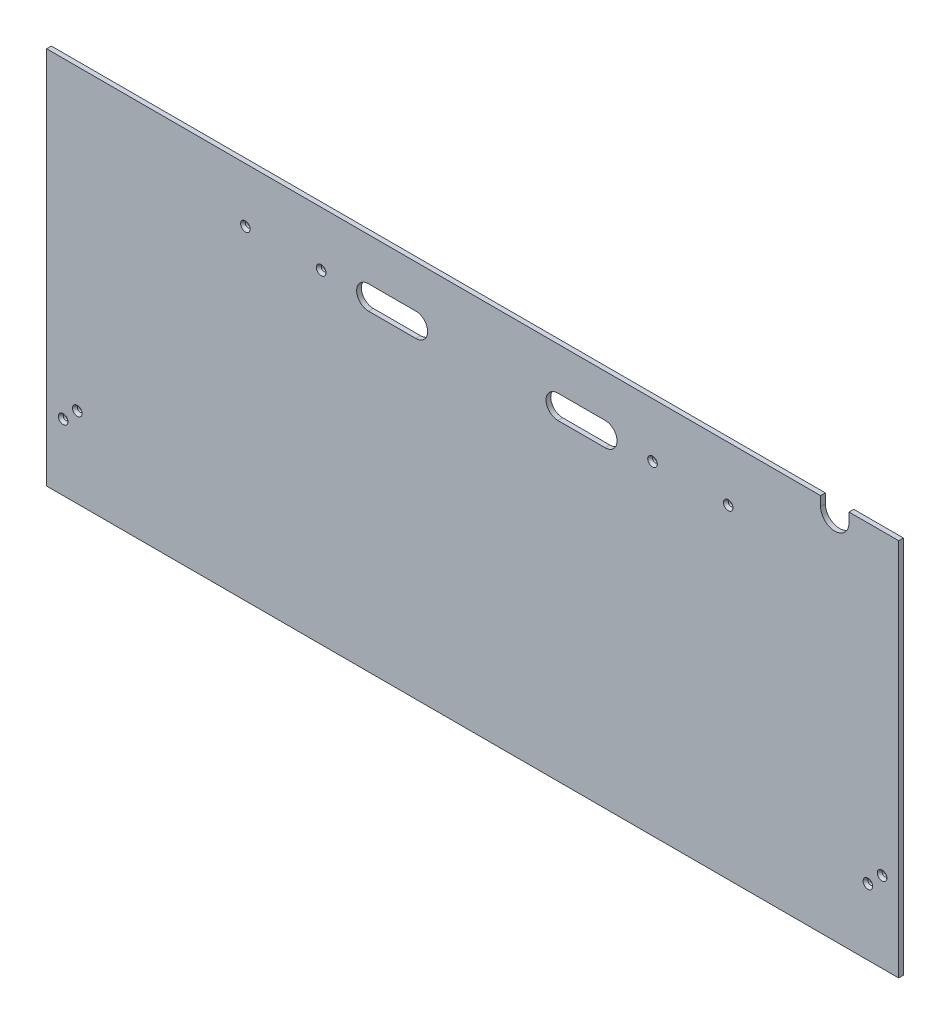
ISO-10303-21;
HEADER;
FILE_DESCRIPTION(('STEP AP214'),'2;1');
FILE_NAME('part.step','',(''),(''),'','','');
FILE_SCHEMA(('AUTOMOTIVE_DESIGN { 1 0 10303 214 1 1 1 1 }'));
ENDSEC;
DATA;
#1=APPLICATION_CONTEXT('core data for automotive mechanical design processes');
#2=APPLICATION_PROTOCOL_DEFINITION('international standard','automotive_design',2000,#1);
#3=PRODUCT_CONTEXT('',#1,'mechanical');
#4=PRODUCT('Part','Part','',(#3));
#5=PRODUCT_RELATED_PRODUCT_CATEGORY('part','',(#4));
#6=PRODUCT_DEFINITION_FORMATION('','',#4);
#7=PRODUCT_DEFINITION_CONTEXT('part definition',#1,'design');
#8=PRODUCT_DEFINITION('design','',#6,#7);
#9=PRODUCT_DEFINITION_SHAPE('','',#8);
#10=(LENGTH_UNIT() NAMED_UNIT(*) SI_UNIT(.MILLI.,.METRE.));
#11=(NAMED_UNIT(*) PLANE_ANGLE_UNIT() SI_UNIT($,.RADIAN.));
#12=(NAMED_UNIT(*) SI_UNIT($,.STERADIAN.) SOLID_ANGLE_UNIT());
#13=UNCERTAINTY_MEASURE_WITH_UNIT(LENGTH_MEASURE(1.E-05),#10,'distance_accuracy_value','');
#14=(GEOMETRIC_REPRESENTATION_CONTEXT(3) GLOBAL_UNCERTAINTY_ASSIGNED_CONTEXT((#13)) GLOBAL_UNIT_ASSIGNED_CONTEXT((#10,
#11,#12)) REPRESENTATION_CONTEXT('',''));
#15=CARTESIAN_POINT('',(0.,0.,0.));
#16=DIRECTION('',(0.,0.,1.));
#17=DIRECTION('',(1.,0.,0.));
#18=AXIS2_PLACEMENT_3D('',#15,#16,#17);
#19=CARTESIAN_POINT('',(0.,508.,6.35));
#20=DIRECTION('',(0.,-1.,0.));
#21=DIRECTION('',(0.,0.,-1.));
#22=AXIS2_PLACEMENT_3D('',#19,#20,#21);
#23=PLANE('',#22);
#24=DIRECTION('',(-1.,0.,0.));
#25=VECTOR('',#24,1.);
#26=CARTESIAN_POINT('',(0.,508.,6.35));
#27=LINE('',#26,#25);
#28=CARTESIAN_POINT('',(1038.225,508.,6.35));
#29=VERTEX_POINT('',#28);
#30=CARTESIAN_POINT('',(0.,508.,6.35));
#31=VERTEX_POINT('',#30);
#32=EDGE_CURVE('E324',#29,#31,#27,.T.);
#33=ORIENTED_EDGE('',*,*,#32,.F.);
#34=DIRECTION('',(0.,0.,1.));
#35=VECTOR('',#34,1.);
#36=CARTESIAN_POINT('',(1038.225,508.,0.));
#37=LINE('',#36,#35);
#38=CARTESIAN_POINT('',(1038.225,508.,0.));
#39=VERTEX_POINT('',#38);
#40=EDGE_CURVE('E175',#39,#29,#37,.T.);
#41=ORIENTED_EDGE('',*,*,#40,.F.);
#42=DIRECTION('',(-1.,0.,0.));
#43=VECTOR('',#42,1.);
#44=CARTESIAN_POINT('',(0.,508.,0.));
#45=LINE('',#44,#43);
#46=CARTESIAN_POINT('',(0.,508.,0.));
#47=VERTEX_POINT('',#46);
#48=EDGE_CURVE('E166',#39,#47,#45,.T.);
#49=ORIENTED_EDGE('',*,*,#48,.T.);
#50=DIRECTION('',(0.,0.,-1.));
#51=VECTOR('',#50,1.);
#52=CARTESIAN_POINT('',(0.,508.,6.35));
#53=LINE('',#52,#51);
#54=EDGE_CURVE('E328',#31,#47,#53,.T.);
#55=ORIENTED_EDGE('',*,*,#54,.F.);
#56=EDGE_LOOP('',(#33,#41,#49,#55));
#57=FACE_BOUND('',#56,.T.);
#58=ADVANCED_FACE('F32',(#57),#23,.F.);
#59=CARTESIAN_POINT('',(0.,0.,6.35));
#60=DIRECTION('',(0.,0.,-1.));
#61=DIRECTION('',(-1.,0.,0.));
#62=AXIS2_PLACEMENT_3D('',#59,#60,#61);
#63=PLANE('',#62);
#64=CARTESIAN_POINT('',(266.7,434.975,6.35));
#65=DIRECTION('',(0.,0.,1.));
#66=DIRECTION('',(1.,0.,0.));
#67=AXIS2_PLACEMENT_3D('',#64,#65,#66);
#68=CIRCLE('',#67,6.43890000000003);
#69=CARTESIAN_POINT('',(273.1389,434.975,6.35));
#70=VERTEX_POINT('',#69);
#71=EDGE_CURVE('E208',#70,#70,#68,.T.);
#72=ORIENTED_EDGE('',*,*,#71,.F.);
#73=EDGE_LOOP('',(#72));
#74=FACE_BOUND('',#73,.T.);
#75=DIRECTION('',(1.,0.,0.));
#76=VECTOR('',#75,1.);
#77=CARTESIAN_POINT('',(431.8,419.1,6.35));
#78=LINE('',#77,#76);
#79=CARTESIAN_POINT('',(431.8,419.1,6.35));
#80=VERTEX_POINT('',#79);
#81=CARTESIAN_POINT('',(495.3,419.1,6.35));
#82=VERTEX_POINT('',#81);
#83=EDGE_CURVE('E269',#80,#82,#78,.T.);
#84=ORIENTED_EDGE('',*,*,#83,.F.);
#85=CARTESIAN_POINT('',(431.8,434.975,6.35));
#86=DIRECTION('',(0.,0.,1.));
#87=DIRECTION('',(1.,0.,0.));
#88=AXIS2_PLACEMENT_3D('',#85,#86,#87);
#89=CIRCLE('',#88,15.875);
#90=CARTESIAN_POINT('',(431.8,450.85,6.35));
#91=VERTEX_POINT('',#90);
#92=EDGE_CURVE('E55',#91,#80,#89,.T.);
#93=ORIENTED_EDGE('',*,*,#92,.F.);
#94=DIRECTION('',(-1.,0.,0.));
#95=VECTOR('',#94,1.);
#96=CARTESIAN_POINT('',(431.8,450.85,6.35));
#97=LINE('',#96,#95);
#98=CARTESIAN_POINT('',(495.3,450.85,6.35));
#99=VERTEX_POINT('',#98);
#100=EDGE_CURVE('E258',#99,#91,#97,.T.);
#101=ORIENTED_EDGE('',*,*,#100,.F.);
#102=CARTESIAN_POINT('',(495.3,434.975,6.35));
#103=DIRECTION('',(0.,0.,1.));
#104=DIRECTION('',(1.,0.,0.));
#105=AXIS2_PLACEMENT_3D('',#102,#103,#104);
#106=CIRCLE('',#105,15.875);
#107=EDGE_CURVE('E273',#82,#99,#106,.T.);
#108=ORIENTED_EDGE('',*,*,#107,.F.);
#109=EDGE_LOOP('',(#84,#93,#101,#108));
#110=FACE_BOUND('',#109,.T.);
#111=DIRECTION('',(1.,0.,0.));
#112=VECTOR('',#111,1.);
#113=CARTESIAN_POINT('',(685.8,419.1,6.35));
#114=LINE('',#113,#112);
#115=CARTESIAN_POINT('',(685.8,419.1,6.35));
#116=VERTEX_POINT('',#115);
#117=CARTESIAN_POINT('',(749.3,419.1,6.35));
#118=VERTEX_POINT('',#117);
#119=EDGE_CURVE('E301',#116,#118,#114,.T.);
#120=ORIENTED_EDGE('',*,*,#119,.F.);
#121=CARTESIAN_POINT('',(685.8,434.975,6.35));
#122=DIRECTION('',(0.,0.,1.));
#123=DIRECTION('',(1.,0.,0.));
#124=AXIS2_PLACEMENT_3D('',#121,#122,#123);
#125=CIRCLE('',#124,15.875);
#126=CARTESIAN_POINT('',(685.8,450.85,6.35));
#127=VERTEX_POINT('',#126);
#128=EDGE_CURVE('E253',#127,#116,#125,.T.);
#129=ORIENTED_EDGE('',*,*,#128,.F.);
#130=DIRECTION('',(-1.,0.,0.));
#131=VECTOR('',#130,1.);
#132=CARTESIAN_POINT('',(685.8,450.85,6.35));
#133=LINE('',#132,#131);
#134=CARTESIAN_POINT('',(749.3,450.85,6.35));
#135=VERTEX_POINT('',#134);
#136=EDGE_CURVE('E290',#135,#127,#133,.T.);
#137=ORIENTED_EDGE('',*,*,#136,.F.);
#138=CARTESIAN_POINT('',(749.3,434.975,6.35));
#139=DIRECTION('',(0.,0.,1.));
#140=DIRECTION('',(1.,0.,0.));
#141=AXIS2_PLACEMENT_3D('',#138,#139,#140);
#142=CIRCLE('',#141,15.875);
#143=EDGE_CURVE('E304',#118,#135,#142,.T.);
#144=ORIENTED_EDGE('',*,*,#143,.F.);
#145=EDGE_LOOP('',(#120,#129,#137,#144));
#146=FACE_BOUND('',#145,.T.);
#147=CARTESIAN_POINT('',(1057.275,495.3,6.35));
#148=DIRECTION('',(0.,0.,1.));
#149=DIRECTION('',(-1.,0.,0.));
#150=AXIS2_PLACEMENT_3D('',#147,#148,#149);
#151=CIRCLE('',#150,19.05);
#152=CARTESIAN_POINT('',(1038.225,495.3,6.35));
#153=VERTEX_POINT('',#152);
#154=CARTESIAN_POINT('',(1076.325,495.3,6.35));
#155=VERTEX_POINT('',#154);
#156=EDGE_CURVE('E169',#153,#155,#151,.T.);
#157=ORIENTED_EDGE('',*,*,#156,.F.);
#158=DIRECTION('',(0.,-1.,0.));
#159=VECTOR('',#158,1.);
#160=CARTESIAN_POINT('',(1038.225,508.,6.35));
#161=LINE('',#160,#159);
#162=EDGE_CURVE('E151',#29,#153,#161,.T.);
#163=ORIENTED_EDGE('',*,*,#162,.F.);
#164=ORIENTED_EDGE('',*,*,#32,.T.);
#165=DIRECTION('',(0.,-1.,0.));
#166=VECTOR('',#165,1.);
#167=CARTESIAN_POINT('',(0.,0.,6.35));
#168=LINE('',#167,#166);
#169=CARTESIAN_POINT('',(0.,0.,6.35));
#170=VERTEX_POINT('',#169);
#171=EDGE_CURVE('E316',#31,#170,#168,.T.);
#172=ORIENTED_EDGE('',*,*,#171,.T.);
#173=DIRECTION('',(1.,0.,0.));
#174=VECTOR('',#173,1.);
#175=CARTESIAN_POINT('',(0.,0.,6.35));
#176=LINE('',#175,#174);
#177=CARTESIAN_POINT('',(1143.,0.,6.35));
#178=VERTEX_POINT('',#177);
#179=EDGE_CURVE('E319',#170,#178,#176,.T.);
#180=ORIENTED_EDGE('',*,*,#179,.T.);
#181=DIRECTION('',(0.,1.,0.));
#182=VECTOR('',#181,1.);
#183=CARTESIAN_POINT('',(1143.,0.,6.35));
#184=LINE('',#183,#182);
#185=CARTESIAN_POINT('',(1143.,508.,6.35));
#186=VERTEX_POINT('',#185);
#187=EDGE_CURVE('E322',#178,#186,#184,.T.);
#188=ORIENTED_EDGE('',*,*,#187,.T.);
#189=CARTESIAN_POINT('',(1076.325,508.,6.35));
#190=VERTEX_POINT('',#189);
#191=EDGE_CURVE('E325',#186,#190,#27,.T.);
#192=ORIENTED_EDGE('',*,*,#191,.T.);
#193=DIRECTION('',(0.,1.,0.));
#194=VECTOR('',#193,1.);
#195=CARTESIAN_POINT('',(1076.325,508.,6.35));
#196=LINE('',#195,#194);
#197=EDGE_CURVE('E167',#155,#190,#196,.T.);
#198=ORIENTED_EDGE('',*,*,#197,.F.);
#199=EDGE_LOOP('',(#157,#163,#164,#172,#180,#188,#192,#198));
#200=FACE_BOUND('',#199,.T.);
#201=CARTESIAN_POINT('',(22.2249999999999,88.9,6.35));
#202=DIRECTION('',(0.,0.,1.));
#203=DIRECTION('',(1.,0.,0.));
#204=AXIS2_PLACEMENT_3D('',#201,#202,#203);
#205=CIRCLE('',#204,6.4389);
#206=CARTESIAN_POINT('',(28.6638999999999,88.9,6.35));
#207=VERTEX_POINT('',#206);
#208=EDGE_CURVE('E244',#207,#207,#205,.T.);
#209=ORIENTED_EDGE('',*,*,#208,.F.);
#210=EDGE_LOOP('',(#209));
#211=FACE_BOUND('',#210,.T.);
#212=CARTESIAN_POINT('',(41.2749999999999,107.95,6.35));
#213=DIRECTION('',(0.,0.,1.));
#214=DIRECTION('',(1.,0.,0.));
#215=AXIS2_PLACEMENT_3D('',#212,#213,#214);
#216=CIRCLE('',#215,6.4389);
#217=CARTESIAN_POINT('',(47.7138999999999,107.95,6.35));
#218=VERTEX_POINT('',#217);
#219=EDGE_CURVE('E235',#218,#218,#216,.T.);
#220=ORIENTED_EDGE('',*,*,#219,.F.);
#221=EDGE_LOOP('',(#220));
#222=FACE_BOUND('',#221,.T.);
#223=CARTESIAN_POINT('',(1101.725,88.9,6.35));
#224=DIRECTION('',(0.,0.,1.));
#225=DIRECTION('',(1.,0.,0.));
#226=AXIS2_PLACEMENT_3D('',#223,#224,#225);
#227=CIRCLE('',#226,6.43890000000003);
#228=CARTESIAN_POINT('',(1108.1639,88.9,6.35));
#229=VERTEX_POINT('',#228);
#230=EDGE_CURVE('E226',#229,#229,#227,.T.);
#231=ORIENTED_EDGE('',*,*,#230,.F.);
#232=EDGE_LOOP('',(#231));
#233=FACE_BOUND('',#232,.T.);
#234=CARTESIAN_POINT('',(1120.775,107.95,6.35));
#235=DIRECTION('',(0.,0.,1.));
#236=DIRECTION('',(1.,0.,0.));
#237=AXIS2_PLACEMENT_3D('',#234,#235,#236);
#238=CIRCLE('',#237,6.43890000000003);
#239=CARTESIAN_POINT('',(1127.2139,107.95,6.35));
#240=VERTEX_POINT('',#239);
#241=EDGE_CURVE('E217',#240,#240,#238,.T.);
#242=ORIENTED_EDGE('',*,*,#241,.F.);
#243=EDGE_LOOP('',(#242));
#244=FACE_BOUND('',#243,.T.);
#245=CARTESIAN_POINT('',(368.3,434.975,6.35));
#246=DIRECTION('',(0.,0.,1.));
#247=DIRECTION('',(1.,0.,0.));
#248=AXIS2_PLACEMENT_3D('',#245,#246,#247);
#249=CIRCLE('',#248,6.43890000000003);
#250=CARTESIAN_POINT('',(374.7389,434.975,6.35));
#251=VERTEX_POINT('',#250);
#252=EDGE_CURVE('E199',#251,#251,#249,.T.);
#253=ORIENTED_EDGE('',*,*,#252,.F.);
#254=EDGE_LOOP('',(#253));
#255=FACE_BOUND('',#254,.T.);
#256=CARTESIAN_POINT('',(812.8,434.975,6.35));
#257=DIRECTION('',(0.,0.,1.));
#258=DIRECTION('',(1.,0.,0.));
#259=AXIS2_PLACEMENT_3D('',#256,#257,#258);
#260=CIRCLE('',#259,6.43890000000003);
#261=CARTESIAN_POINT('',(819.2389,434.975,6.35));
#262=VERTEX_POINT('',#261);
#263=EDGE_CURVE('E190',#262,#262,#260,.T.);
#264=ORIENTED_EDGE('',*,*,#263,.F.);
#265=EDGE_LOOP('',(#264));
#266=FACE_BOUND('',#265,.T.);
#267=CARTESIAN_POINT('',(914.4,434.975,6.35));
#268=DIRECTION('',(0.,0.,1.));
#269=DIRECTION('',(1.,0.,0.));
#270=AXIS2_PLACEMENT_3D('',#267,#268,#269);
#271=CIRCLE('',#270,6.43890000000003);
#272=CARTESIAN_POINT('',(920.8389,434.975,6.35));
#273=VERTEX_POINT('',#272);
#274=EDGE_CURVE('E177',#273,#273,#271,.T.);
#275=ORIENTED_EDGE('',*,*,#274,.F.);
#276=EDGE_LOOP('',(#275));
#277=FACE_BOUND('',#276,.T.);
#278=ADVANCED_FACE('F355',(#74,#110,#146,#200,#211,#222,#233,#244,#255,#266,#277),#63,.F.);
#279=CARTESIAN_POINT('',(0.,0.,6.35));
#280=DIRECTION('',(1.,0.,0.));
#281=DIRECTION('',(0.,0.,-1.));
#282=AXIS2_PLACEMENT_3D('',#279,#280,#281);
#283=PLANE('',#282);
#284=DIRECTION('',(0.,-1.,0.));
#285=VECTOR('',#284,1.);
#286=CARTESIAN_POINT('',(0.,0.,0.));
#287=LINE('',#286,#285);
#288=CARTESIAN_POINT('',(0.,0.,0.));
#289=VERTEX_POINT('',#288);
#290=EDGE_CURVE('E280',#47,#289,#287,.T.);
#291=ORIENTED_EDGE('',*,*,#290,.T.);
#292=DIRECTION('',(0.,0.,-1.));
#293=VECTOR('',#292,1.);
#294=CARTESIAN_POINT('',(0.,0.,6.35));
#295=LINE('',#294,#293);
#296=EDGE_CURVE('E11',#170,#289,#295,.T.);
#297=ORIENTED_EDGE('',*,*,#296,.F.);
#298=ORIENTED_EDGE('',*,*,#171,.F.);
#299=ORIENTED_EDGE('',*,*,#54,.T.);
#300=EDGE_LOOP('',(#291,#297,#298,#299));
#301=FACE_BOUND('',#300,.T.);
#302=ADVANCED_FACE('F34',(#301),#283,.F.);
#303=CARTESIAN_POINT('',(0.,0.,6.35));
#304=DIRECTION('',(0.,1.,0.));
#305=DIRECTION('',(0.,0.,1.));
#306=AXIS2_PLACEMENT_3D('',#303,#304,#305);
#307=PLANE('',#306);
#308=DIRECTION('',(1.,0.,0.));
#309=VECTOR('',#308,1.);
#310=CARTESIAN_POINT('',(0.,0.,0.));
#311=LINE('',#310,#309);
#312=CARTESIAN_POINT('',(1143.,0.,0.));
#313=VERTEX_POINT('',#312);
#314=EDGE_CURVE('E331',#289,#313,#311,.T.);
#315=ORIENTED_EDGE('',*,*,#314,.T.);
#316=DIRECTION('',(0.,0.,-1.));
#317=VECTOR('',#316,1.);
#318=CARTESIAN_POINT('',(1143.,0.,6.35));
#319=LINE('',#318,#317);
#320=EDGE_CURVE('E40',#178,#313,#319,.T.);
#321=ORIENTED_EDGE('',*,*,#320,.F.);
#322=ORIENTED_EDGE('',*,*,#179,.F.);
#323=ORIENTED_EDGE('',*,*,#296,.T.);
#324=EDGE_LOOP('',(#315,#321,#322,#323));
#325=FACE_BOUND('',#324,.T.);
#326=ADVANCED_FACE('F359',(#325),#307,.F.);
#327=CARTESIAN_POINT('',(1143.,0.,6.35));
#328=DIRECTION('',(-1.,0.,0.));
#329=DIRECTION('',(0.,0.,1.));
#330=AXIS2_PLACEMENT_3D('',#327,#328,#329);
#331=PLANE('',#330);
#332=DIRECTION('',(0.,1.,0.));
#333=VECTOR('',#332,1.);
#334=CARTESIAN_POINT('',(1143.,0.,0.));
#335=LINE('',#334,#333);
#336=CARTESIAN_POINT('',(1143.,508.,0.));
#337=VERTEX_POINT('',#336);
#338=EDGE_CURVE('E333',#313,#337,#335,.T.);
#339=ORIENTED_EDGE('',*,*,#338,.T.);
#340=DIRECTION('',(0.,0.,-1.));
#341=VECTOR('',#340,1.);
#342=CARTESIAN_POINT('',(1143.,508.,6.35));
#343=LINE('',#342,#341);
#344=EDGE_CURVE('E339',#186,#337,#343,.T.);
#345=ORIENTED_EDGE('',*,*,#344,.F.);
#346=ORIENTED_EDGE('',*,*,#187,.F.);
#347=ORIENTED_EDGE('',*,*,#320,.T.);
#348=EDGE_LOOP('',(#339,#345,#346,#347));
#349=FACE_BOUND('',#348,.T.);
#350=ADVANCED_FACE('F346',(#349),#331,.F.);
#351=CARTESIAN_POINT('',(1076.325,508.,0.));
#352=VERTEX_POINT('',#351);
#353=EDGE_CURVE('E320',#337,#352,#45,.T.);
#354=ORIENTED_EDGE('',*,*,#353,.T.);
#355=DIRECTION('',(0.,0.,1.));
#356=VECTOR('',#355,1.);
#357=CARTESIAN_POINT('',(1076.325,508.,0.));
#358=LINE('',#357,#356);
#359=EDGE_CURVE('E178',#352,#190,#358,.T.);
#360=ORIENTED_EDGE('',*,*,#359,.T.);
#361=ORIENTED_EDGE('',*,*,#191,.F.);
#362=ORIENTED_EDGE('',*,*,#344,.T.);
#363=EDGE_LOOP('',(#354,#360,#361,#362));
#364=FACE_BOUND('',#363,.T.);
#365=ADVANCED_FACE('F351',(#364),#23,.F.);
#366=CARTESIAN_POINT('',(0.,0.,0.));
#367=DIRECTION('',(0.,0.,-1.));
#368=DIRECTION('',(-1.,0.,0.));
#369=AXIS2_PLACEMENT_3D('',#366,#367,#368);
#370=PLANE('',#369);
#371=DIRECTION('',(0.,-1.,0.));
#372=VECTOR('',#371,1.);
#373=CARTESIAN_POINT('',(1038.225,508.,0.));
#374=LINE('',#373,#372);
#375=CARTESIAN_POINT('',(1038.225,495.3,0.));
#376=VERTEX_POINT('',#375);
#377=EDGE_CURVE('E148',#39,#376,#374,.T.);
#378=ORIENTED_EDGE('',*,*,#377,.T.);
#379=CARTESIAN_POINT('',(1057.275,495.3,0.));
#380=DIRECTION('',(0.,0.,1.));
#381=DIRECTION('',(-1.,0.,0.));
#382=AXIS2_PLACEMENT_3D('',#379,#380,#381);
#383=CIRCLE('',#382,19.05);
#384=CARTESIAN_POINT('',(1076.325,495.3,0.));
#385=VERTEX_POINT('',#384);
#386=EDGE_CURVE('E158',#376,#385,#383,.T.);
#387=ORIENTED_EDGE('',*,*,#386,.T.);
#388=DIRECTION('',(0.,1.,0.));
#389=VECTOR('',#388,1.);
#390=CARTESIAN_POINT('',(1076.325,508.,0.));
#391=LINE('',#390,#389);
#392=EDGE_CURVE('E47',#385,#352,#391,.T.);
#393=ORIENTED_EDGE('',*,*,#392,.T.);
#394=ORIENTED_EDGE('',*,*,#353,.F.);
#395=ORIENTED_EDGE('',*,*,#338,.F.);
#396=ORIENTED_EDGE('',*,*,#314,.F.);
#397=ORIENTED_EDGE('',*,*,#290,.F.);
#398=ORIENTED_EDGE('',*,*,#48,.F.);
#399=EDGE_LOOP('',(#378,#387,#393,#394,#395,#396,#397,#398));
#400=FACE_BOUND('',#399,.T.);
#401=CARTESIAN_POINT('',(914.4,434.975,0.));
#402=DIRECTION('',(0.,0.,-1.));
#403=DIRECTION('',(-1.,0.,0.));
#404=AXIS2_PLACEMENT_3D('',#401,#402,#403);
#405=CIRCLE('',#404,3.3782);
#406=CARTESIAN_POINT('',(911.0218,434.975,0.));
#407=VERTEX_POINT('',#406);
#408=EDGE_CURVE('E187',#407,#407,#405,.T.);
#409=ORIENTED_EDGE('',*,*,#408,.F.);
#410=EDGE_LOOP('',(#409));
#411=FACE_BOUND('',#410,.T.);
#412=CARTESIAN_POINT('',(812.8,434.975,0.));
#413=DIRECTION('',(0.,0.,-1.));
#414=DIRECTION('',(-1.,0.,0.));
#415=AXIS2_PLACEMENT_3D('',#412,#413,#414);
#416=CIRCLE('',#415,3.3782);
#417=CARTESIAN_POINT('',(809.4218,434.975,0.));
#418=VERTEX_POINT('',#417);
#419=EDGE_CURVE('E196',#418,#418,#416,.T.);
#420=ORIENTED_EDGE('',*,*,#419,.F.);
#421=EDGE_LOOP('',(#420));
#422=FACE_BOUND('',#421,.T.);
#423=CARTESIAN_POINT('',(368.3,434.975,0.));
#424=DIRECTION('',(0.,0.,-1.));
#425=DIRECTION('',(-1.,0.,0.));
#426=AXIS2_PLACEMENT_3D('',#423,#424,#425);
#427=CIRCLE('',#426,3.3782);
#428=CARTESIAN_POINT('',(364.9218,434.975,0.));
#429=VERTEX_POINT('',#428);
#430=EDGE_CURVE('E205',#429,#429,#427,.T.);
#431=ORIENTED_EDGE('',*,*,#430,.F.);
#432=EDGE_LOOP('',(#431));
#433=FACE_BOUND('',#432,.T.);
#434=CARTESIAN_POINT('',(266.7,434.975,0.));
#435=DIRECTION('',(0.,0.,-1.));
#436=DIRECTION('',(-1.,0.,0.));
#437=AXIS2_PLACEMENT_3D('',#434,#435,#436);
#438=CIRCLE('',#437,3.3782);
#439=CARTESIAN_POINT('',(263.3218,434.975,0.));
#440=VERTEX_POINT('',#439);
#441=EDGE_CURVE('E214',#440,#440,#438,.T.);
#442=ORIENTED_EDGE('',*,*,#441,.F.);
#443=EDGE_LOOP('',(#442));
#444=FACE_BOUND('',#443,.T.);
#445=CARTESIAN_POINT('',(1120.775,107.95,0.));
#446=DIRECTION('',(0.,0.,-1.));
#447=DIRECTION('',(-1.,0.,0.));
#448=AXIS2_PLACEMENT_3D('',#445,#446,#447);
#449=CIRCLE('',#448,3.3782);
#450=CARTESIAN_POINT('',(1117.3968,107.95,0.));
#451=VERTEX_POINT('',#450);
#452=EDGE_CURVE('E223',#451,#451,#449,.T.);
#453=ORIENTED_EDGE('',*,*,#452,.F.);
#454=EDGE_LOOP('',(#453));
#455=FACE_BOUND('',#454,.T.);
#456=CARTESIAN_POINT('',(1101.725,88.9,0.));
#457=DIRECTION('',(0.,0.,-1.));
#458=DIRECTION('',(-1.,0.,0.));
#459=AXIS2_PLACEMENT_3D('',#456,#457,#458);
#460=CIRCLE('',#459,3.3782);
#461=CARTESIAN_POINT('',(1098.3468,88.9,0.));
#462=VERTEX_POINT('',#461);
#463=EDGE_CURVE('E232',#462,#462,#460,.T.);
#464=ORIENTED_EDGE('',*,*,#463,.F.);
#465=EDGE_LOOP('',(#464));
#466=FACE_BOUND('',#465,.T.);
#467=CARTESIAN_POINT('',(41.2749999999999,107.95,0.));
#468=DIRECTION('',(0.,0.,-1.));
#469=DIRECTION('',(-1.,0.,0.));
#470=AXIS2_PLACEMENT_3D('',#467,#468,#469);
#471=CIRCLE('',#470,3.3782);
#472=CARTESIAN_POINT('',(37.8968,107.95,0.));
#473=VERTEX_POINT('',#472);
#474=EDGE_CURVE('E241',#473,#473,#471,.T.);
#475=ORIENTED_EDGE('',*,*,#474,.F.);
#476=EDGE_LOOP('',(#475));
#477=FACE_BOUND('',#476,.T.);
#478=CARTESIAN_POINT('',(22.2249999999999,88.9,0.));
#479=DIRECTION('',(0.,0.,-1.));
#480=DIRECTION('',(-1.,0.,0.));
#481=AXIS2_PLACEMENT_3D('',#478,#479,#480);
#482=CIRCLE('',#481,3.3782);
#483=CARTESIAN_POINT('',(18.8467999999999,88.9,0.));
#484=VERTEX_POINT('',#483);
#485=EDGE_CURVE('E250',#484,#484,#482,.T.);
#486=ORIENTED_EDGE('',*,*,#485,.F.);
#487=EDGE_LOOP('',(#486));
#488=FACE_BOUND('',#487,.T.);
#489=CARTESIAN_POINT('',(431.8,434.975,0.));
#490=DIRECTION('',(0.,0.,1.));
#491=DIRECTION('',(1.,0.,0.));
#492=AXIS2_PLACEMENT_3D('',#489,#490,#491);
#493=CIRCLE('',#492,15.875);
#494=CARTESIAN_POINT('',(431.8,450.85,0.));
#495=VERTEX_POINT('',#494);
#496=CARTESIAN_POINT('',(431.8,419.1,0.));
#497=VERTEX_POINT('',#496);
#498=EDGE_CURVE('E254',#495,#497,#493,.T.);
#499=ORIENTED_EDGE('',*,*,#498,.T.);
#500=DIRECTION('',(1.,0.,0.));
#501=VECTOR('',#500,1.);
#502=CARTESIAN_POINT('',(431.8,419.1,0.));
#503=LINE('',#502,#501);
#504=CARTESIAN_POINT('',(495.3,419.1,0.));
#505=VERTEX_POINT('',#504);
#506=EDGE_CURVE('E257',#497,#505,#503,.T.);
#507=ORIENTED_EDGE('',*,*,#506,.T.);
#508=CARTESIAN_POINT('',(495.3,434.975,0.));
#509=DIRECTION('',(0.,0.,1.));
#510=DIRECTION('',(1.,0.,0.));
#511=AXIS2_PLACEMENT_3D('',#508,#509,#510);
#512=CIRCLE('',#511,15.875);
#513=CARTESIAN_POINT('',(495.3,450.85,0.));
#514=VERTEX_POINT('',#513);
#515=EDGE_CURVE('E261',#505,#514,#512,.T.);
#516=ORIENTED_EDGE('',*,*,#515,.T.);
#517=DIRECTION('',(-1.,0.,0.));
#518=VECTOR('',#517,1.);
#519=CARTESIAN_POINT('',(431.8,450.85,0.));
#520=LINE('',#519,#518);
#521=EDGE_CURVE('E264',#514,#495,#520,.T.);
#522=ORIENTED_EDGE('',*,*,#521,.T.);
#523=EDGE_LOOP('',(#499,#507,#516,#522));
#524=FACE_BOUND('',#523,.T.);
#525=CARTESIAN_POINT('',(685.8,434.975,0.));
#526=DIRECTION('',(0.,0.,1.));
#527=DIRECTION('',(1.,0.,0.));
#528=AXIS2_PLACEMENT_3D('',#525,#526,#527);
#529=CIRCLE('',#528,15.875);
#530=CARTESIAN_POINT('',(685.8,450.85,0.));
#531=VERTEX_POINT('',#530);
#532=CARTESIAN_POINT('',(685.8,419.1,0.));
#533=VERTEX_POINT('',#532);
#534=EDGE_CURVE('E286',#531,#533,#529,.T.);
#535=ORIENTED_EDGE('',*,*,#534,.T.);
#536=DIRECTION('',(1.,0.,0.));
#537=VECTOR('',#536,1.);
#538=CARTESIAN_POINT('',(685.8,419.1,0.));
#539=LINE('',#538,#537);
#540=CARTESIAN_POINT('',(749.3,419.1,0.));
#541=VERTEX_POINT('',#540);
#542=EDGE_CURVE('E289',#533,#541,#539,.T.);
#543=ORIENTED_EDGE('',*,*,#542,.T.);
#544=CARTESIAN_POINT('',(749.3,434.975,0.));
#545=DIRECTION('',(0.,0.,1.));
#546=DIRECTION('',(1.,0.,0.));
#547=AXIS2_PLACEMENT_3D('',#544,#545,#546);
#548=CIRCLE('',#547,15.875);
#549=CARTESIAN_POINT('',(749.3,450.85,0.));
#550=VERTEX_POINT('',#549);
#551=EDGE_CURVE('E293',#541,#550,#548,.T.);
#552=ORIENTED_EDGE('',*,*,#551,.T.);
#553=DIRECTION('',(-1.,0.,0.));
#554=VECTOR('',#553,1.);
#555=CARTESIAN_POINT('',(685.8,450.85,0.));
#556=LINE('',#555,#554);
#557=EDGE_CURVE('E296',#550,#531,#556,.T.);
#558=ORIENTED_EDGE('',*,*,#557,.T.);
#559=EDGE_LOOP('',(#535,#543,#552,#558));
#560=FACE_BOUND('',#559,.T.);
#561=ADVANCED_FACE('F163',(#400,#411,#422,#433,#444,#455,#466,#477,#488,#524,#560),#370,.T.);
#562=CARTESIAN_POINT('',(685.8,434.975,0.));
#563=DIRECTION('',(0.,0.,1.));
#564=DIRECTION('',(1.,0.,0.));
#565=AXIS2_PLACEMENT_3D('',#562,#563,#564);
#566=CYLINDRICAL_SURFACE('',#565,15.875);
#567=ORIENTED_EDGE('',*,*,#128,.T.);
#568=DIRECTION('',(0.,0.,1.));
#569=VECTOR('',#568,1.);
#570=CARTESIAN_POINT('',(685.8,419.1,0.));
#571=LINE('',#570,#569);
#572=EDGE_CURVE('E299',#533,#116,#571,.T.);
#573=ORIENTED_EDGE('',*,*,#572,.F.);
#574=ORIENTED_EDGE('',*,*,#534,.F.);
#575=DIRECTION('',(0.,0.,1.));
#576=VECTOR('',#575,1.);
#577=CARTESIAN_POINT('',(685.8,450.85,0.));
#578=LINE('',#577,#576);
#579=EDGE_CURVE('E270',#531,#127,#578,.T.);
#580=ORIENTED_EDGE('',*,*,#579,.T.);
#581=EDGE_LOOP('',(#567,#573,#574,#580));
#582=FACE_BOUND('',#581,.T.);
#583=ADVANCED_FACE('F378',(#582),#566,.F.);
#584=CARTESIAN_POINT('',(685.8,450.85,0.));
#585=DIRECTION('',(0.,1.,0.));
#586=DIRECTION('',(0.,0.,1.));
#587=AXIS2_PLACEMENT_3D('',#584,#585,#586);
#588=PLANE('',#587);
#589=ORIENTED_EDGE('',*,*,#136,.T.);
#590=ORIENTED_EDGE('',*,*,#579,.F.);
#591=ORIENTED_EDGE('',*,*,#557,.F.);
#592=DIRECTION('',(0.,0.,1.));
#593=VECTOR('',#592,1.);
#594=CARTESIAN_POINT('',(749.3,450.85,0.));
#595=LINE('',#594,#593);
#596=EDGE_CURVE('E310',#550,#135,#595,.T.);
#597=ORIENTED_EDGE('',*,*,#596,.T.);
#598=EDGE_LOOP('',(#589,#590,#591,#597));
#599=FACE_BOUND('',#598,.T.);
#600=ADVANCED_FACE('F519',(#599),#588,.F.);
#601=CARTESIAN_POINT('',(749.3,434.975,0.));
#602=DIRECTION('',(0.,0.,1.));
#603=DIRECTION('',(1.,0.,0.));
#604=AXIS2_PLACEMENT_3D('',#601,#602,#603);
#605=CYLINDRICAL_SURFACE('',#604,15.875);
#606=ORIENTED_EDGE('',*,*,#143,.T.);
#607=ORIENTED_EDGE('',*,*,#596,.F.);
#608=ORIENTED_EDGE('',*,*,#551,.F.);
#609=DIRECTION('',(0.,0.,1.));
#610=VECTOR('',#609,1.);
#611=CARTESIAN_POINT('',(749.3,419.1,0.));
#612=LINE('',#611,#610);
#613=EDGE_CURVE('E312',#541,#118,#612,.T.);
#614=ORIENTED_EDGE('',*,*,#613,.T.);
#615=EDGE_LOOP('',(#606,#607,#608,#614));
#616=FACE_BOUND('',#615,.T.);
#617=ADVANCED_FACE('F522',(#616),#605,.F.);
#618=CARTESIAN_POINT('',(685.8,419.1,0.));
#619=DIRECTION('',(0.,-1.,0.));
#620=DIRECTION('',(0.,0.,-1.));
#621=AXIS2_PLACEMENT_3D('',#618,#619,#620);
#622=PLANE('',#621);
#623=ORIENTED_EDGE('',*,*,#119,.T.);
#624=ORIENTED_EDGE('',*,*,#613,.F.);
#625=ORIENTED_EDGE('',*,*,#542,.F.);
#626=ORIENTED_EDGE('',*,*,#572,.T.);
#627=EDGE_LOOP('',(#623,#624,#625,#626));
#628=FACE_BOUND('',#627,.T.);
#629=ADVANCED_FACE('F518',(#628),#622,.F.);
#630=CARTESIAN_POINT('',(431.8,434.975,0.));
#631=DIRECTION('',(0.,0.,1.));
#632=DIRECTION('',(1.,0.,0.));
#633=AXIS2_PLACEMENT_3D('',#630,#631,#632);
#634=CYLINDRICAL_SURFACE('',#633,15.875);
#635=ORIENTED_EDGE('',*,*,#92,.T.);
#636=DIRECTION('',(0.,0.,1.));
#637=VECTOR('',#636,1.);
#638=CARTESIAN_POINT('',(431.8,419.1,0.));
#639=LINE('',#638,#637);
#640=EDGE_CURVE('E267',#497,#80,#639,.T.);
#641=ORIENTED_EDGE('',*,*,#640,.F.);
#642=ORIENTED_EDGE('',*,*,#498,.F.);
#643=DIRECTION('',(0.,0.,1.));
#644=VECTOR('',#643,1.);
#645=CARTESIAN_POINT('',(431.8,450.85,0.));
#646=LINE('',#645,#644);
#647=EDGE_CURVE('E278',#495,#91,#646,.T.);
#648=ORIENTED_EDGE('',*,*,#647,.T.);
#649=EDGE_LOOP('',(#635,#641,#642,#648));
#650=FACE_BOUND('',#649,.T.);
#651=ADVANCED_FACE('F508',(#650),#634,.F.);
#652=CARTESIAN_POINT('',(431.8,450.85,0.));
#653=DIRECTION('',(0.,1.,0.));
#654=DIRECTION('',(0.,0.,1.));
#655=AXIS2_PLACEMENT_3D('',#652,#653,#654);
#656=PLANE('',#655);
#657=ORIENTED_EDGE('',*,*,#100,.T.);
#658=ORIENTED_EDGE('',*,*,#647,.F.);
#659=ORIENTED_EDGE('',*,*,#521,.F.);
#660=DIRECTION('',(0.,0.,1.));
#661=VECTOR('',#660,1.);
#662=CARTESIAN_POINT('',(495.3,450.85,0.));
#663=LINE('',#662,#661);
#664=EDGE_CURVE('E281',#514,#99,#663,.T.);
#665=ORIENTED_EDGE('',*,*,#664,.T.);
#666=EDGE_LOOP('',(#657,#658,#659,#665));
#667=FACE_BOUND('',#666,.T.);
#668=ADVANCED_FACE('F504',(#667),#656,.F.);
#669=CARTESIAN_POINT('',(495.3,434.975,0.));
#670=DIRECTION('',(0.,0.,1.));
#671=DIRECTION('',(1.,0.,0.));
#672=AXIS2_PLACEMENT_3D('',#669,#670,#671);
#673=CYLINDRICAL_SURFACE('',#672,15.875);
#674=ORIENTED_EDGE('',*,*,#107,.T.);
#675=ORIENTED_EDGE('',*,*,#664,.F.);
#676=ORIENTED_EDGE('',*,*,#515,.F.);
#677=DIRECTION('',(0.,0.,1.));
#678=VECTOR('',#677,1.);
#679=CARTESIAN_POINT('',(495.3,419.1,0.));
#680=LINE('',#679,#678);
#681=EDGE_CURVE('E283',#505,#82,#680,.T.);
#682=ORIENTED_EDGE('',*,*,#681,.T.);
#683=EDGE_LOOP('',(#674,#675,#676,#682));
#684=FACE_BOUND('',#683,.T.);
#685=ADVANCED_FACE('F507',(#684),#673,.F.);
#686=CARTESIAN_POINT('',(431.8,419.1,0.));
#687=DIRECTION('',(0.,-1.,0.));
#688=DIRECTION('',(0.,0.,-1.));
#689=AXIS2_PLACEMENT_3D('',#686,#687,#688);
#690=PLANE('',#689);
#691=ORIENTED_EDGE('',*,*,#83,.T.);
#692=ORIENTED_EDGE('',*,*,#681,.F.);
#693=ORIENTED_EDGE('',*,*,#506,.F.);
#694=ORIENTED_EDGE('',*,*,#640,.T.);
#695=EDGE_LOOP('',(#691,#692,#693,#694));
#696=FACE_BOUND('',#695,.T.);
#697=ADVANCED_FACE('F502',(#696),#690,.F.);
#698=CARTESIAN_POINT('',(22.2249999999999,88.9,6.35));
#699=DIRECTION('',(0.,0.,1.));
#700=DIRECTION('',(1.,0.,0.));
#701=AXIS2_PLACEMENT_3D('',#698,#699,#700);
#702=CYLINDRICAL_SURFACE('',#701,3.3782);
#703=CARTESIAN_POINT('',(22.2249999999999,88.9,2.82906741601866));
#704=DIRECTION('',(0.,0.,1.));
#705=DIRECTION('',(1.,0.,0.));
#706=AXIS2_PLACEMENT_3D('',#703,#704,#705);
#707=CIRCLE('',#706,3.3782);
#708=CARTESIAN_POINT('',(25.6031999999999,88.9,2.82906741601866));
#709=VERTEX_POINT('',#708);
#710=EDGE_CURVE('E247',#709,#709,#707,.T.);
#711=ORIENTED_EDGE('',*,*,#710,.T.);
#712=EDGE_LOOP('',(#711));
#713=FACE_BOUND('',#712,.T.);
#714=ORIENTED_EDGE('',*,*,#485,.T.);
#715=EDGE_LOOP('',(#714));
#716=FACE_BOUND('',#715,.T.);
#717=ADVANCED_FACE('F498',(#713,#716),#702,.F.);
#718=CARTESIAN_POINT('',(22.2249999999999,88.9,6.35));
#719=DIRECTION('',(0.,0.,1.));
#720=DIRECTION('',(1.,0.,0.));
#721=AXIS2_PLACEMENT_3D('',#718,#719,#720);
#722=CONICAL_SURFACE('',#721,6.4389,0.715584993317677);
#723=ORIENTED_EDGE('',*,*,#710,.F.);
#724=EDGE_LOOP('',(#723));
#725=FACE_BOUND('',#724,.T.);
#726=ORIENTED_EDGE('',*,*,#208,.T.);
#727=EDGE_LOOP('',(#726));
#728=FACE_BOUND('',#727,.T.);
#729=ADVANCED_FACE('F494',(#725,#728),#722,.F.);
#730=CARTESIAN_POINT('',(41.2749999999999,107.95,6.35));
#731=DIRECTION('',(0.,0.,1.));
#732=DIRECTION('',(1.,0.,0.));
#733=AXIS2_PLACEMENT_3D('',#730,#731,#732);
#734=CYLINDRICAL_SURFACE('',#733,3.3782);
#735=CARTESIAN_POINT('',(41.2749999999999,107.95,2.82906741601866));
#736=DIRECTION('',(0.,0.,1.));
#737=DIRECTION('',(1.,0.,0.));
#738=AXIS2_PLACEMENT_3D('',#735,#736,#737);
#739=CIRCLE('',#738,3.3782);
#740=CARTESIAN_POINT('',(44.6531999999999,107.95,2.82906741601866));
#741=VERTEX_POINT('',#740);
#742=EDGE_CURVE('E238',#741,#741,#739,.T.);
#743=ORIENTED_EDGE('',*,*,#742,.T.);
#744=EDGE_LOOP('',(#743));
#745=FACE_BOUND('',#744,.T.);
#746=ORIENTED_EDGE('',*,*,#474,.T.);
#747=EDGE_LOOP('',(#746));
#748=FACE_BOUND('',#747,.T.);
#749=ADVANCED_FACE('F490',(#745,#748),#734,.F.);
#750=CARTESIAN_POINT('',(41.2749999999999,107.95,6.35));
#751=DIRECTION('',(0.,0.,1.));
#752=DIRECTION('',(1.,0.,0.));
#753=AXIS2_PLACEMENT_3D('',#750,#751,#752);
#754=CONICAL_SURFACE('',#753,6.4389,0.715584993317676);
#755=ORIENTED_EDGE('',*,*,#742,.F.);
#756=EDGE_LOOP('',(#755));
#757=FACE_BOUND('',#756,.T.);
#758=ORIENTED_EDGE('',*,*,#219,.T.);
#759=EDGE_LOOP('',(#758));
#760=FACE_BOUND('',#759,.T.);
#761=ADVANCED_FACE('F486',(#757,#760),#754,.F.);
#762=CARTESIAN_POINT('',(1101.725,88.9,6.35));
#763=DIRECTION('',(0.,0.,1.));
#764=DIRECTION('',(1.,0.,0.));
#765=AXIS2_PLACEMENT_3D('',#762,#763,#764);
#766=CYLINDRICAL_SURFACE('',#765,3.3782);
#767=CARTESIAN_POINT('',(1101.725,88.9,2.82906741601866));
#768=DIRECTION('',(0.,0.,1.));
#769=DIRECTION('',(1.,0.,0.));
#770=AXIS2_PLACEMENT_3D('',#767,#768,#769);
#771=CIRCLE('',#770,3.3782);
#772=CARTESIAN_POINT('',(1105.1032,88.9,2.82906741601866));
#773=VERTEX_POINT('',#772);
#774=EDGE_CURVE('E229',#773,#773,#771,.T.);
#775=ORIENTED_EDGE('',*,*,#774,.T.);
#776=EDGE_LOOP('',(#775));
#777=FACE_BOUND('',#776,.T.);
#778=ORIENTED_EDGE('',*,*,#463,.T.);
#779=EDGE_LOOP('',(#778));
#780=FACE_BOUND('',#779,.T.);
#781=ADVANCED_FACE('F482',(#777,#780),#766,.F.);
#782=CARTESIAN_POINT('',(1101.725,88.9,6.35));
#783=DIRECTION('',(0.,0.,1.));
#784=DIRECTION('',(1.,0.,0.));
#785=AXIS2_PLACEMENT_3D('',#782,#783,#784);
#786=CONICAL_SURFACE('',#785,6.43890000000003,0.715584993317681);
#787=ORIENTED_EDGE('',*,*,#774,.F.);
#788=EDGE_LOOP('',(#787));
#789=FACE_BOUND('',#788,.T.);
#790=ORIENTED_EDGE('',*,*,#230,.T.);
#791=EDGE_LOOP('',(#790));
#792=FACE_BOUND('',#791,.T.);
#793=ADVANCED_FACE('F478',(#789,#792),#786,.F.);
#794=CARTESIAN_POINT('',(1120.775,107.95,6.35));
#795=DIRECTION('',(0.,0.,1.));
#796=DIRECTION('',(1.,0.,0.));
#797=AXIS2_PLACEMENT_3D('',#794,#795,#796);
#798=CYLINDRICAL_SURFACE('',#797,3.3782);
#799=CARTESIAN_POINT('',(1120.775,107.95,2.82906741601866));
#800=DIRECTION('',(0.,0.,1.));
#801=DIRECTION('',(1.,0.,0.));
#802=AXIS2_PLACEMENT_3D('',#799,#800,#801);
#803=CIRCLE('',#802,3.3782);
#804=CARTESIAN_POINT('',(1124.1532,107.95,2.82906741601866));
#805=VERTEX_POINT('',#804);
#806=EDGE_CURVE('E220',#805,#805,#803,.T.);
#807=ORIENTED_EDGE('',*,*,#806,.T.);
#808=EDGE_LOOP('',(#807));
#809=FACE_BOUND('',#808,.T.);
#810=ORIENTED_EDGE('',*,*,#452,.T.);
#811=EDGE_LOOP('',(#810));
#812=FACE_BOUND('',#811,.T.);
#813=ADVANCED_FACE('F474',(#809,#812),#798,.F.);
#814=CARTESIAN_POINT('',(1120.775,107.95,6.35));
#815=DIRECTION('',(0.,0.,1.));
#816=DIRECTION('',(1.,0.,0.));
#817=AXIS2_PLACEMENT_3D('',#814,#815,#816);
#818=CONICAL_SURFACE('',#817,6.43890000000003,0.715584993317681);
#819=ORIENTED_EDGE('',*,*,#806,.F.);
#820=EDGE_LOOP('',(#819));
#821=FACE_BOUND('',#820,.T.);
#822=ORIENTED_EDGE('',*,*,#241,.T.);
#823=EDGE_LOOP('',(#822));
#824=FACE_BOUND('',#823,.T.);
#825=ADVANCED_FACE('F470',(#821,#824),#818,.F.);
#826=CARTESIAN_POINT('',(266.7,434.975,6.35));
#827=DIRECTION('',(0.,0.,1.));
#828=DIRECTION('',(1.,0.,0.));
#829=AXIS2_PLACEMENT_3D('',#826,#827,#828);
#830=CYLINDRICAL_SURFACE('',#829,3.3782);
#831=CARTESIAN_POINT('',(266.7,434.975,2.82906741601866));
#832=DIRECTION('',(0.,0.,1.));
#833=DIRECTION('',(1.,0.,0.));
#834=AXIS2_PLACEMENT_3D('',#831,#832,#833);
#835=CIRCLE('',#834,3.3782);
#836=CARTESIAN_POINT('',(270.0782,434.975,2.82906741601866));
#837=VERTEX_POINT('',#836);
#838=EDGE_CURVE('E211',#837,#837,#835,.T.);
#839=ORIENTED_EDGE('',*,*,#838,.T.);
#840=EDGE_LOOP('',(#839));
#841=FACE_BOUND('',#840,.T.);
#842=ORIENTED_EDGE('',*,*,#441,.T.);
#843=EDGE_LOOP('',(#842));
#844=FACE_BOUND('',#843,.T.);
#845=ADVANCED_FACE('F466',(#841,#844),#830,.F.);
#846=CARTESIAN_POINT('',(266.7,434.975,6.35));
#847=DIRECTION('',(0.,0.,1.));
#848=DIRECTION('',(1.,0.,0.));
#849=AXIS2_PLACEMENT_3D('',#846,#847,#848);
#850=CONICAL_SURFACE('',#849,6.43890000000003,0.715584993317681);
#851=ORIENTED_EDGE('',*,*,#838,.F.);
#852=EDGE_LOOP('',(#851));
#853=FACE_BOUND('',#852,.T.);
#854=ORIENTED_EDGE('',*,*,#71,.T.);
#855=EDGE_LOOP('',(#854));
#856=FACE_BOUND('',#855,.T.);
#857=ADVANCED_FACE('F462',(#853,#856),#850,.F.);
#858=CARTESIAN_POINT('',(368.3,434.975,6.35));
#859=DIRECTION('',(0.,0.,1.));
#860=DIRECTION('',(1.,0.,0.));
#861=AXIS2_PLACEMENT_3D('',#858,#859,#860);
#862=CYLINDRICAL_SURFACE('',#861,3.3782);
#863=CARTESIAN_POINT('',(368.3,434.975,2.82906741601866));
#864=DIRECTION('',(0.,0.,1.));
#865=DIRECTION('',(1.,0.,0.));
#866=AXIS2_PLACEMENT_3D('',#863,#864,#865);
#867=CIRCLE('',#866,3.3782);
#868=CARTESIAN_POINT('',(371.6782,434.975,2.82906741601866));
#869=VERTEX_POINT('',#868);
#870=EDGE_CURVE('E202',#869,#869,#867,.T.);
#871=ORIENTED_EDGE('',*,*,#870,.T.);
#872=EDGE_LOOP('',(#871));
#873=FACE_BOUND('',#872,.T.);
#874=ORIENTED_EDGE('',*,*,#430,.T.);
#875=EDGE_LOOP('',(#874));
#876=FACE_BOUND('',#875,.T.);
#877=ADVANCED_FACE('F458',(#873,#876),#862,.F.);
#878=CARTESIAN_POINT('',(368.3,434.975,6.35));
#879=DIRECTION('',(0.,0.,1.));
#880=DIRECTION('',(1.,0.,0.));
#881=AXIS2_PLACEMENT_3D('',#878,#879,#880);
#882=CONICAL_SURFACE('',#881,6.43890000000003,0.715584993317681);
#883=ORIENTED_EDGE('',*,*,#870,.F.);
#884=EDGE_LOOP('',(#883));
#885=FACE_BOUND('',#884,.T.);
#886=ORIENTED_EDGE('',*,*,#252,.T.);
#887=EDGE_LOOP('',(#886));
#888=FACE_BOUND('',#887,.T.);
#889=ADVANCED_FACE('F454',(#885,#888),#882,.F.);
#890=CARTESIAN_POINT('',(812.8,434.975,6.35));
#891=DIRECTION('',(0.,0.,1.));
#892=DIRECTION('',(1.,0.,0.));
#893=AXIS2_PLACEMENT_3D('',#890,#891,#892);
#894=CYLINDRICAL_SURFACE('',#893,3.3782);
#895=CARTESIAN_POINT('',(812.8,434.975,2.82906741601866));
#896=DIRECTION('',(0.,0.,1.));
#897=DIRECTION('',(1.,0.,0.));
#898=AXIS2_PLACEMENT_3D('',#895,#896,#897);
#899=CIRCLE('',#898,3.3782);
#900=CARTESIAN_POINT('',(816.1782,434.975,2.82906741601866));
#901=VERTEX_POINT('',#900);
#902=EDGE_CURVE('E193',#901,#901,#899,.T.);
#903=ORIENTED_EDGE('',*,*,#902,.T.);
#904=EDGE_LOOP('',(#903));
#905=FACE_BOUND('',#904,.T.);
#906=ORIENTED_EDGE('',*,*,#419,.T.);
#907=EDGE_LOOP('',(#906));
#908=FACE_BOUND('',#907,.T.);
#909=ADVANCED_FACE('F450',(#905,#908),#894,.F.);
#910=CARTESIAN_POINT('',(812.8,434.975,6.35));
#911=DIRECTION('',(0.,0.,1.));
#912=DIRECTION('',(1.,0.,0.));
#913=AXIS2_PLACEMENT_3D('',#910,#911,#912);
#914=CONICAL_SURFACE('',#913,6.43890000000003,0.715584993317681);
#915=ORIENTED_EDGE('',*,*,#902,.F.);
#916=EDGE_LOOP('',(#915));
#917=FACE_BOUND('',#916,.T.);
#918=ORIENTED_EDGE('',*,*,#263,.T.);
#919=EDGE_LOOP('',(#918));
#920=FACE_BOUND('',#919,.T.);
#921=ADVANCED_FACE('F446',(#917,#920),#914,.F.);
#922=CARTESIAN_POINT('',(914.4,434.975,6.35));
#923=DIRECTION('',(0.,0.,1.));
#924=DIRECTION('',(1.,0.,0.));
#925=AXIS2_PLACEMENT_3D('',#922,#923,#924);
#926=CYLINDRICAL_SURFACE('',#925,3.3782);
#927=CARTESIAN_POINT('',(914.4,434.975,2.82906741601866));
#928=DIRECTION('',(0.,0.,1.));
#929=DIRECTION('',(1.,0.,0.));
#930=AXIS2_PLACEMENT_3D('',#927,#928,#929);
#931=CIRCLE('',#930,3.3782);
#932=CARTESIAN_POINT('',(917.7782,434.975,2.82906741601866));
#933=VERTEX_POINT('',#932);
#934=EDGE_CURVE('E184',#933,#933,#931,.T.);
#935=ORIENTED_EDGE('',*,*,#934,.T.);
#936=EDGE_LOOP('',(#935));
#937=FACE_BOUND('',#936,.T.);
#938=ORIENTED_EDGE('',*,*,#408,.T.);
#939=EDGE_LOOP('',(#938));
#940=FACE_BOUND('',#939,.T.);
#941=ADVANCED_FACE('F442',(#937,#940),#926,.F.);
#942=CARTESIAN_POINT('',(914.4,434.975,6.35));
#943=DIRECTION('',(0.,0.,1.));
#944=DIRECTION('',(1.,0.,0.));
#945=AXIS2_PLACEMENT_3D('',#942,#943,#944);
#946=CONICAL_SURFACE('',#945,6.43890000000003,0.715584993317681);
#947=ORIENTED_EDGE('',*,*,#934,.F.);
#948=EDGE_LOOP('',(#947));
#949=FACE_BOUND('',#948,.T.);
#950=ORIENTED_EDGE('',*,*,#274,.T.);
#951=EDGE_LOOP('',(#950));
#952=FACE_BOUND('',#951,.T.);
#953=ADVANCED_FACE('F419',(#949,#952),#946,.F.);
#954=CARTESIAN_POINT('',(1038.225,508.,0.));
#955=DIRECTION('',(-1.,0.,0.));
#956=DIRECTION('',(0.,0.,1.));
#957=AXIS2_PLACEMENT_3D('',#954,#955,#956);
#958=PLANE('',#957);
#959=ORIENTED_EDGE('',*,*,#162,.T.);
#960=DIRECTION('',(0.,0.,1.));
#961=VECTOR('',#960,1.);
#962=CARTESIAN_POINT('',(1038.225,495.3,0.));
#963=LINE('',#962,#961);
#964=EDGE_CURVE('E144',#376,#153,#963,.T.);
#965=ORIENTED_EDGE('',*,*,#964,.F.);
#966=ORIENTED_EDGE('',*,*,#377,.F.);
#967=ORIENTED_EDGE('',*,*,#40,.T.);
#968=EDGE_LOOP('',(#959,#965,#966,#967));
#969=FACE_BOUND('',#968,.T.);
#970=ADVANCED_FACE('F146',(#969),#958,.F.);
#971=CARTESIAN_POINT('',(1076.325,508.,0.));
#972=DIRECTION('',(1.,0.,0.));
#973=DIRECTION('',(0.,0.,-1.));
#974=AXIS2_PLACEMENT_3D('',#971,#972,#973);
#975=PLANE('',#974);
#976=ORIENTED_EDGE('',*,*,#197,.T.);
#977=ORIENTED_EDGE('',*,*,#359,.F.);
#978=ORIENTED_EDGE('',*,*,#392,.F.);
#979=DIRECTION('',(0.,0.,1.));
#980=VECTOR('',#979,1.);
#981=CARTESIAN_POINT('',(1076.325,495.3,0.));
#982=LINE('',#981,#980);
#983=EDGE_CURVE('E155',#385,#155,#982,.T.);
#984=ORIENTED_EDGE('',*,*,#983,.T.);
#985=EDGE_LOOP('',(#976,#977,#978,#984));
#986=FACE_BOUND('',#985,.T.);
#987=ADVANCED_FACE('F418',(#986),#975,.F.);
#988=CARTESIAN_POINT('',(1057.275,495.3,0.));
#989=DIRECTION('',(0.,0.,1.));
#990=DIRECTION('',(1.,0.,0.));
#991=AXIS2_PLACEMENT_3D('',#988,#989,#990);
#992=CYLINDRICAL_SURFACE('',#991,19.05);
#993=ORIENTED_EDGE('',*,*,#156,.T.);
#994=ORIENTED_EDGE('',*,*,#983,.F.);
#995=ORIENTED_EDGE('',*,*,#386,.F.);
#996=ORIENTED_EDGE('',*,*,#964,.T.);
#997=EDGE_LOOP('',(#993,#994,#995,#996));
#998=FACE_BOUND('',#997,.T.);
#999=ADVANCED_FACE('F159',(#998),#992,.F.);
#1000=CLOSED_SHELL('',(#58,#278,#302,#326,#350,#365,#561,#583,#600,#617,#629,#651,#668,#685,
#697,#717,#729,#749,#761,#781,#793,#813,#825,#845,#857,#877,#889,#909,#921,#941,#953,#970,#987,#999));
#1001=MANIFOLD_SOLID_BREP('B2',#1000);
#1002=ADVANCED_BREP_SHAPE_REPRESENTATION('',(#18,#1001),#14);
#1003=SHAPE_DEFINITION_REPRESENTATION(#9,#1002);
ENDSEC;
END-ISO-10303-21;
